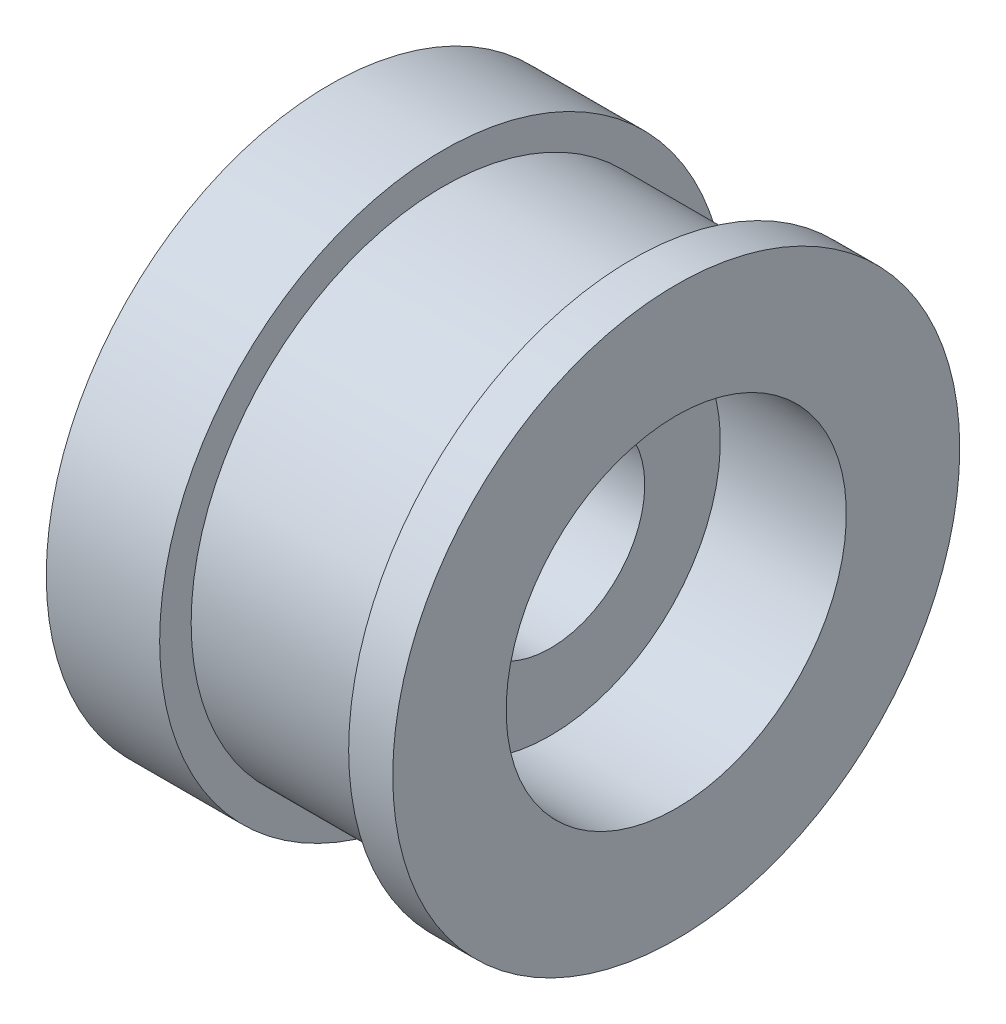
ISO-10303-21;
HEADER;
FILE_DESCRIPTION(('STEP AP214'),'2;1');
FILE_NAME('part.step','',(''),(''),'','','');
FILE_SCHEMA(('AUTOMOTIVE_DESIGN { 1 0 10303 214 1 1 1 1 }'));
ENDSEC;
DATA;
#1=APPLICATION_CONTEXT('core data for automotive mechanical design processes');
#2=APPLICATION_PROTOCOL_DEFINITION('international standard','automotive_design',2000,#1);
#3=PRODUCT_CONTEXT('',#1,'mechanical');
#4=PRODUCT('Part','Part','',(#3));
#5=PRODUCT_RELATED_PRODUCT_CATEGORY('part','',(#4));
#6=PRODUCT_DEFINITION_FORMATION('','',#4);
#7=PRODUCT_DEFINITION_CONTEXT('part definition',#1,'design');
#8=PRODUCT_DEFINITION('design','',#6,#7);
#9=PRODUCT_DEFINITION_SHAPE('','',#8);
#10=(LENGTH_UNIT() NAMED_UNIT(*) SI_UNIT(.MILLI.,.METRE.));
#11=(NAMED_UNIT(*) PLANE_ANGLE_UNIT() SI_UNIT($,.RADIAN.));
#12=(NAMED_UNIT(*) SI_UNIT($,.STERADIAN.) SOLID_ANGLE_UNIT());
#13=UNCERTAINTY_MEASURE_WITH_UNIT(LENGTH_MEASURE(1.E-05),#10,'distance_accuracy_value','');
#14=(GEOMETRIC_REPRESENTATION_CONTEXT(3) GLOBAL_UNCERTAINTY_ASSIGNED_CONTEXT((#13)) GLOBAL_UNIT_ASSIGNED_CONTEXT((#10,
#11,#12)) REPRESENTATION_CONTEXT('',''));
#15=CARTESIAN_POINT('',(0.,0.,0.));
#16=DIRECTION('',(0.,0.,1.));
#17=DIRECTION('',(1.,0.,0.));
#18=AXIS2_PLACEMENT_3D('',#15,#16,#17);
#19=CARTESIAN_POINT('',(1.8,-4.554,-4.554));
#20=DIRECTION('',(-1.,0.,0.));
#21=DIRECTION('',(0.,0.,1.));
#22=AXIS2_PLACEMENT_3D('',#19,#20,#21);
#23=PLANE('',#22);
#24=CARTESIAN_POINT('',(1.8,0.,0.));
#25=DIRECTION('',(-1.,0.,0.));
#26=DIRECTION('',(0.,0.,1.));
#27=AXIS2_PLACEMENT_3D('',#24,#25,#26);
#28=CIRCLE('',#27,4.);
#29=CARTESIAN_POINT('',(1.8,0.,4.));
#30=VERTEX_POINT('',#29);
#31=EDGE_CURVE('E47',#30,#30,#28,.T.);
#32=ORIENTED_EDGE('',*,*,#31,.T.);
#33=EDGE_LOOP('',(#32));
#34=FACE_BOUND('',#33,.T.);
#35=CARTESIAN_POINT('',(1.8,0.,0.));
#36=DIRECTION('',(-1.,0.,0.));
#37=DIRECTION('',(0.,0.,1.));
#38=AXIS2_PLACEMENT_3D('',#35,#36,#37);
#39=CIRCLE('',#38,4.5);
#40=CARTESIAN_POINT('',(1.8,0.,4.5));
#41=VERTEX_POINT('',#40);
#42=EDGE_CURVE('E19',#41,#41,#39,.F.);
#43=ORIENTED_EDGE('',*,*,#42,.T.);
#44=EDGE_LOOP('',(#43));
#45=FACE_BOUND('',#44,.T.);
#46=ADVANCED_FACE('F15',(#34,#45),#23,.F.);
#47=CARTESIAN_POINT('',(1.8,0.,0.));
#48=DIRECTION('',(-1.,0.,0.));
#49=DIRECTION('',(0.,0.,1.));
#50=AXIS2_PLACEMENT_3D('',#47,#48,#49);
#51=CYLINDRICAL_SURFACE('',#50,4.5);
#52=CARTESIAN_POINT('',(0.,0.,0.));
#53=DIRECTION('',(-1.,0.,0.));
#54=DIRECTION('',(0.,0.,1.));
#55=AXIS2_PLACEMENT_3D('',#52,#53,#54);
#56=CIRCLE('',#55,4.5);
#57=CARTESIAN_POINT('',(0.,0.,4.5));
#58=VERTEX_POINT('',#57);
#59=EDGE_CURVE('E45',#58,#58,#56,.F.);
#60=ORIENTED_EDGE('',*,*,#59,.T.);
#61=EDGE_LOOP('',(#60));
#62=FACE_BOUND('',#61,.T.);
#63=ORIENTED_EDGE('',*,*,#42,.F.);
#64=EDGE_LOOP('',(#63));
#65=FACE_BOUND('',#64,.T.);
#66=ADVANCED_FACE('F55',(#62,#65),#51,.T.);
#67=CARTESIAN_POINT('',(4.8,0.,0.));
#68=DIRECTION('',(-1.,0.,0.));
#69=DIRECTION('',(0.,0.,1.));
#70=AXIS2_PLACEMENT_3D('',#67,#68,#69);
#71=CYLINDRICAL_SURFACE('',#70,4.);
#72=ORIENTED_EDGE('',*,*,#31,.F.);
#73=EDGE_LOOP('',(#72));
#74=FACE_BOUND('',#73,.T.);
#75=CARTESIAN_POINT('',(4.8,0.,0.));
#76=DIRECTION('',(-1.,0.,0.));
#77=DIRECTION('',(0.,0.,1.));
#78=AXIS2_PLACEMENT_3D('',#75,#76,#77);
#79=CIRCLE('',#78,4.);
#80=CARTESIAN_POINT('',(4.8,0.,4.));
#81=VERTEX_POINT('',#80);
#82=EDGE_CURVE('E42',#81,#81,#79,.T.);
#83=ORIENTED_EDGE('',*,*,#82,.T.);
#84=EDGE_LOOP('',(#83));
#85=FACE_BOUND('',#84,.T.);
#86=ADVANCED_FACE('F57',(#74,#85),#71,.T.);
#87=CARTESIAN_POINT('',(0.,-4.554,4.554));
#88=DIRECTION('',(1.,0.,0.));
#89=DIRECTION('',(0.,0.,-1.));
#90=AXIS2_PLACEMENT_3D('',#87,#88,#89);
#91=PLANE('',#90);
#92=CARTESIAN_POINT('',(0.,0.,0.));
#93=DIRECTION('',(-1.,0.,0.));
#94=DIRECTION('',(0.,-1.,0.));
#95=AXIS2_PLACEMENT_3D('',#92,#93,#94);
#96=CIRCLE('',#95,1.5);
#97=CARTESIAN_POINT('',(0.,-1.5,0.));
#98=VERTEX_POINT('',#97);
#99=EDGE_CURVE('E39',#98,#98,#96,.T.);
#100=ORIENTED_EDGE('',*,*,#99,.F.);
#101=EDGE_LOOP('',(#100));
#102=FACE_BOUND('',#101,.T.);
#103=ORIENTED_EDGE('',*,*,#59,.F.);
#104=EDGE_LOOP('',(#103));
#105=FACE_BOUND('',#104,.T.);
#106=ADVANCED_FACE('F65',(#102,#105),#91,.F.);
#107=CARTESIAN_POINT('',(4.8,-4.554,4.554));
#108=DIRECTION('',(1.,0.,0.));
#109=DIRECTION('',(0.,0.,-1.));
#110=AXIS2_PLACEMENT_3D('',#107,#108,#109);
#111=PLANE('',#110);
#112=ORIENTED_EDGE('',*,*,#82,.F.);
#113=EDGE_LOOP('',(#112));
#114=FACE_BOUND('',#113,.T.);
#115=CARTESIAN_POINT('',(4.8,0.,0.));
#116=DIRECTION('',(-1.,0.,0.));
#117=DIRECTION('',(0.,0.,1.));
#118=AXIS2_PLACEMENT_3D('',#115,#116,#117);
#119=CIRCLE('',#118,4.5);
#120=CARTESIAN_POINT('',(4.8,0.,4.5));
#121=VERTEX_POINT('',#120);
#122=EDGE_CURVE('E36',#121,#121,#119,.T.);
#123=ORIENTED_EDGE('',*,*,#122,.T.);
#124=EDGE_LOOP('',(#123));
#125=FACE_BOUND('',#124,.T.);
#126=ADVANCED_FACE('F85',(#114,#125),#111,.F.);
#127=CARTESIAN_POINT('',(3.5,0.,0.));
#128=DIRECTION('',(-1.,0.,0.));
#129=DIRECTION('',(0.,-1.,0.));
#130=AXIS2_PLACEMENT_3D('',#127,#128,#129);
#131=CYLINDRICAL_SURFACE('',#130,1.5);
#132=ORIENTED_EDGE('',*,*,#99,.T.);
#133=EDGE_LOOP('',(#132));
#134=FACE_BOUND('',#133,.T.);
#135=CARTESIAN_POINT('',(3.5,0.,0.));
#136=DIRECTION('',(-1.,0.,0.));
#137=DIRECTION('',(0.,-1.,0.));
#138=AXIS2_PLACEMENT_3D('',#135,#136,#137);
#139=CIRCLE('',#138,1.5);
#140=CARTESIAN_POINT('',(3.5,-1.5,0.));
#141=VERTEX_POINT('',#140);
#142=EDGE_CURVE('E33',#141,#141,#139,.T.);
#143=ORIENTED_EDGE('',*,*,#142,.F.);
#144=EDGE_LOOP('',(#143));
#145=FACE_BOUND('',#144,.T.);
#146=ADVANCED_FACE('F82',(#134,#145),#131,.F.);
#147=CARTESIAN_POINT('',(5.5,0.,0.));
#148=DIRECTION('',(-1.,0.,0.));
#149=DIRECTION('',(0.,0.,1.));
#150=AXIS2_PLACEMENT_3D('',#147,#148,#149);
#151=CYLINDRICAL_SURFACE('',#150,4.5);
#152=ORIENTED_EDGE('',*,*,#122,.F.);
#153=EDGE_LOOP('',(#152));
#154=FACE_BOUND('',#153,.T.);
#155=CARTESIAN_POINT('',(5.50000000000001,0.,0.));
#156=DIRECTION('',(-1.,0.,0.));
#157=DIRECTION('',(0.,0.,1.));
#158=AXIS2_PLACEMENT_3D('',#155,#156,#157);
#159=CIRCLE('',#158,4.5);
#160=CARTESIAN_POINT('',(5.50000000000001,0.,4.5));
#161=VERTEX_POINT('',#160);
#162=EDGE_CURVE('E28',#161,#161,#159,.T.);
#163=ORIENTED_EDGE('',*,*,#162,.T.);
#164=EDGE_LOOP('',(#163));
#165=FACE_BOUND('',#164,.T.);
#166=ADVANCED_FACE('F79',(#154,#165),#151,.T.);
#167=CARTESIAN_POINT('',(3.5,-2.7324,2.7324));
#168=DIRECTION('',(1.,0.,0.));
#169=DIRECTION('',(0.,0.,-1.));
#170=AXIS2_PLACEMENT_3D('',#167,#168,#169);
#171=PLANE('',#170);
#172=ORIENTED_EDGE('',*,*,#142,.T.);
#173=EDGE_LOOP('',(#172));
#174=FACE_BOUND('',#173,.T.);
#175=CARTESIAN_POINT('',(3.5,0.,0.));
#176=DIRECTION('',(1.,0.,0.));
#177=DIRECTION('',(0.,1.,0.));
#178=AXIS2_PLACEMENT_3D('',#175,#176,#177);
#179=CIRCLE('',#178,2.7);
#180=CARTESIAN_POINT('',(3.5,2.7,0.));
#181=VERTEX_POINT('',#180);
#182=EDGE_CURVE('E23',#181,#181,#179,.F.);
#183=ORIENTED_EDGE('',*,*,#182,.F.);
#184=EDGE_LOOP('',(#183));
#185=FACE_BOUND('',#184,.T.);
#186=ADVANCED_FACE('F75',(#174,#185),#171,.T.);
#187=CARTESIAN_POINT('',(5.5,-4.554,-4.554));
#188=DIRECTION('',(-1.,0.,0.));
#189=DIRECTION('',(0.,0.,1.));
#190=AXIS2_PLACEMENT_3D('',#187,#188,#189);
#191=PLANE('',#190);
#192=CARTESIAN_POINT('',(5.5,0.,0.));
#193=DIRECTION('',(1.,0.,0.));
#194=DIRECTION('',(0.,1.,0.));
#195=AXIS2_PLACEMENT_3D('',#192,#193,#194);
#196=CIRCLE('',#195,2.7);
#197=CARTESIAN_POINT('',(5.5,2.7,0.));
#198=VERTEX_POINT('',#197);
#199=EDGE_CURVE('E10',#198,#198,#196,.T.);
#200=ORIENTED_EDGE('',*,*,#199,.F.);
#201=EDGE_LOOP('',(#200));
#202=FACE_BOUND('',#201,.T.);
#203=ORIENTED_EDGE('',*,*,#162,.F.);
#204=EDGE_LOOP('',(#203));
#205=FACE_BOUND('',#204,.T.);
#206=ADVANCED_FACE('F17',(#202,#205),#191,.F.);
#207=CARTESIAN_POINT('',(3.5,0.,0.));
#208=DIRECTION('',(1.,0.,0.));
#209=DIRECTION('',(0.,1.,0.));
#210=AXIS2_PLACEMENT_3D('',#207,#208,#209);
#211=CYLINDRICAL_SURFACE('',#210,2.7);
#212=ORIENTED_EDGE('',*,*,#199,.T.);
#213=EDGE_LOOP('',(#212));
#214=FACE_BOUND('',#213,.T.);
#215=ORIENTED_EDGE('',*,*,#182,.T.);
#216=EDGE_LOOP('',(#215));
#217=FACE_BOUND('',#216,.T.);
#218=ADVANCED_FACE('F69',(#214,#217),#211,.F.);
#219=CLOSED_SHELL('',(#46,#66,#86,#106,#126,#146,#166,#186,#206,#218));
#220=MANIFOLD_SOLID_BREP('B1',#219);
#221=ADVANCED_BREP_SHAPE_REPRESENTATION('',(#18,#220),#14);
#222=SHAPE_DEFINITION_REPRESENTATION(#9,#221);
ENDSEC;
END-ISO-10303-21;
